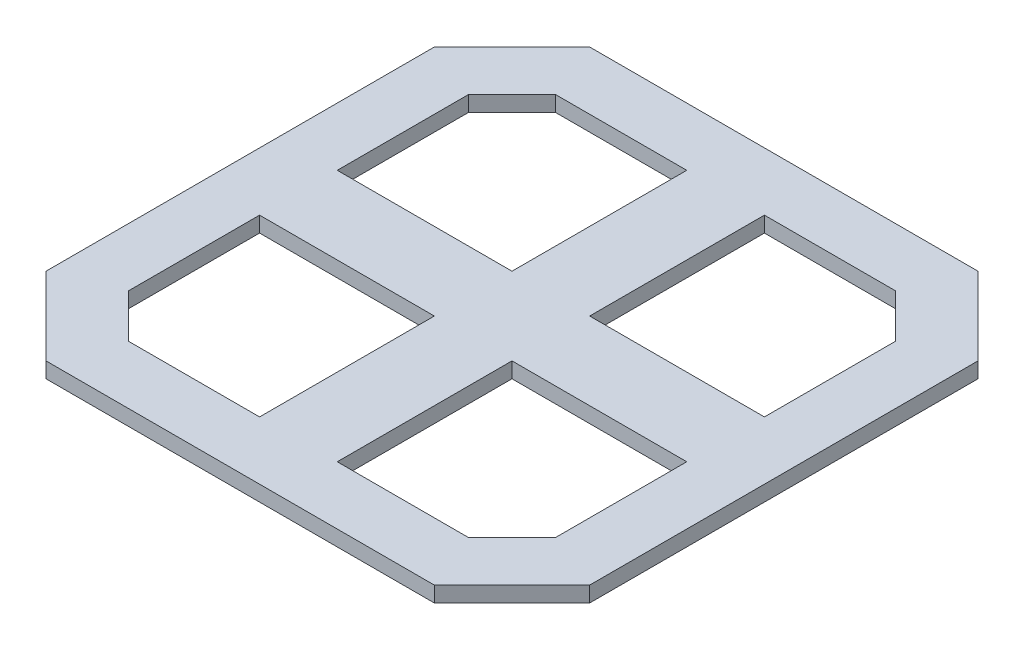
ISO-10303-21;
HEADER;
FILE_DESCRIPTION(('STEP AP214'),'2;1');
FILE_NAME('part.step','',(''),(''),'','','');
FILE_SCHEMA(('AUTOMOTIVE_DESIGN { 1 0 10303 214 1 1 1 1 }'));
ENDSEC;
DATA;
#1=APPLICATION_CONTEXT('core data for automotive mechanical design processes');
#2=APPLICATION_PROTOCOL_DEFINITION('international standard','automotive_design',2000,#1);
#3=PRODUCT_CONTEXT('',#1,'mechanical');
#4=PRODUCT('Part','Part','',(#3));
#5=PRODUCT_RELATED_PRODUCT_CATEGORY('part','',(#4));
#6=PRODUCT_DEFINITION_FORMATION('','',#4);
#7=PRODUCT_DEFINITION_CONTEXT('part definition',#1,'design');
#8=PRODUCT_DEFINITION('design','',#6,#7);
#9=PRODUCT_DEFINITION_SHAPE('','',#8);
#10=(LENGTH_UNIT() NAMED_UNIT(*) SI_UNIT(.MILLI.,.METRE.));
#11=(NAMED_UNIT(*) PLANE_ANGLE_UNIT() SI_UNIT($,.RADIAN.));
#12=(NAMED_UNIT(*) SI_UNIT($,.STERADIAN.) SOLID_ANGLE_UNIT());
#13=UNCERTAINTY_MEASURE_WITH_UNIT(LENGTH_MEASURE(1.E-05),#10,'distance_accuracy_value','');
#14=(GEOMETRIC_REPRESENTATION_CONTEXT(3) GLOBAL_UNCERTAINTY_ASSIGNED_CONTEXT((#13)) GLOBAL_UNIT_ASSIGNED_CONTEXT((#10,
#11,#12)) REPRESENTATION_CONTEXT('',''));
#15=CARTESIAN_POINT('',(0.,0.,0.));
#16=DIRECTION('',(0.,0.,1.));
#17=DIRECTION('',(1.,0.,0.));
#18=AXIS2_PLACEMENT_3D('',#15,#16,#17);
#19=CARTESIAN_POINT('',(35.,2.,-35.));
#20=DIRECTION('',(-1.,0.,0.));
#21=DIRECTION('',(0.,0.,1.));
#22=AXIS2_PLACEMENT_3D('',#19,#20,#21);
#23=PLANE('',#22);
#24=DIRECTION('',(0.,0.,-1.));
#25=VECTOR('',#24,1.);
#26=CARTESIAN_POINT('',(35.,0.,-35.));
#27=LINE('',#26,#25);
#28=CARTESIAN_POINT('',(35.,0.,25.));
#29=VERTEX_POINT('',#28);
#30=CARTESIAN_POINT('',(35.,0.,-24.9999999999994));
#31=VERTEX_POINT('',#30);
#32=EDGE_CURVE('E424',#29,#31,#27,.T.);
#33=ORIENTED_EDGE('',*,*,#32,.T.);
#34=DIRECTION('',(0.,-1.,0.));
#35=VECTOR('',#34,1.);
#36=CARTESIAN_POINT('',(35.0000000000003,33.8198051533949,-24.9999999999994));
#37=LINE('',#36,#35);
#38=CARTESIAN_POINT('',(35.0000000000003,2.,-24.9999999999994));
#39=VERTEX_POINT('',#38);
#40=EDGE_CURVE('E311',#39,#31,#37,.T.);
#41=ORIENTED_EDGE('',*,*,#40,.F.);
#42=DIRECTION('',(0.,0.,-1.));
#43=VECTOR('',#42,1.);
#44=CARTESIAN_POINT('',(35.,2.,-35.));
#45=LINE('',#44,#43);
#46=CARTESIAN_POINT('',(35.,2.,25.));
#47=VERTEX_POINT('',#46);
#48=EDGE_CURVE('E425',#47,#39,#45,.T.);
#49=ORIENTED_EDGE('',*,*,#48,.F.);
#50=DIRECTION('',(0.,-1.,0.));
#51=VECTOR('',#50,1.);
#52=CARTESIAN_POINT('',(35.,33.8198051533947,25.));
#53=LINE('',#52,#51);
#54=EDGE_CURVE('E418',#47,#29,#53,.T.);
#55=ORIENTED_EDGE('',*,*,#54,.T.);
#56=EDGE_LOOP('',(#33,#41,#49,#55));
#57=FACE_BOUND('',#56,.T.);
#58=ADVANCED_FACE('F36',(#57),#23,.F.);
#59=CARTESIAN_POINT('',(-35.,2.,-35.));
#60=DIRECTION('',(0.,0.,1.));
#61=DIRECTION('',(1.,0.,0.));
#62=AXIS2_PLACEMENT_3D('',#59,#60,#61);
#63=PLANE('',#62);
#64=DIRECTION('',(-1.,0.,0.));
#65=VECTOR('',#64,1.);
#66=CARTESIAN_POINT('',(-35.,2.,-35.));
#67=LINE('',#66,#65);
#68=CARTESIAN_POINT('',(25.0000000000004,2.,-34.9999999999997));
#69=VERTEX_POINT('',#68);
#70=CARTESIAN_POINT('',(-24.9999999999998,2.,-35.));
#71=VERTEX_POINT('',#70);
#72=EDGE_CURVE('E428',#69,#71,#67,.T.);
#73=ORIENTED_EDGE('',*,*,#72,.F.);
#74=DIRECTION('',(0.,-1.,0.));
#75=VECTOR('',#74,1.);
#76=CARTESIAN_POINT('',(25.0000000000004,33.8198051533949,-34.9999999999997));
#77=LINE('',#76,#75);
#78=CARTESIAN_POINT('',(25.0000000000004,0.,-34.9999999999997));
#79=VERTEX_POINT('',#78);
#80=EDGE_CURVE('E308',#69,#79,#77,.T.);
#81=ORIENTED_EDGE('',*,*,#80,.T.);
#82=DIRECTION('',(-1.,0.,0.));
#83=VECTOR('',#82,1.);
#84=CARTESIAN_POINT('',(-35.,0.,-35.));
#85=LINE('',#84,#83);
#86=CARTESIAN_POINT('',(-24.9999999999998,0.,-35.));
#87=VERTEX_POINT('',#86);
#88=EDGE_CURVE('E434',#79,#87,#85,.T.);
#89=ORIENTED_EDGE('',*,*,#88,.T.);
#90=DIRECTION('',(0.,-1.,0.));
#91=VECTOR('',#90,1.);
#92=CARTESIAN_POINT('',(-24.9999999999998,33.8198051533947,-35.));
#93=LINE('',#92,#91);
#94=EDGE_CURVE('E328',#71,#87,#93,.T.);
#95=ORIENTED_EDGE('',*,*,#94,.F.);
#96=EDGE_LOOP('',(#73,#81,#89,#95));
#97=FACE_BOUND('',#96,.T.);
#98=ADVANCED_FACE('F470',(#97),#63,.F.);
#99=CARTESIAN_POINT('',(-35.,2.,-35.));
#100=DIRECTION('',(1.,0.,0.));
#101=DIRECTION('',(0.,0.,-1.));
#102=AXIS2_PLACEMENT_3D('',#99,#100,#101);
#103=PLANE('',#102);
#104=DIRECTION('',(0.,0.,1.));
#105=VECTOR('',#104,1.);
#106=CARTESIAN_POINT('',(-35.,2.,-35.));
#107=LINE('',#106,#105);
#108=CARTESIAN_POINT('',(-35.,2.,-25.));
#109=VERTEX_POINT('',#108);
#110=CARTESIAN_POINT('',(-35.0000000000001,2.,24.9999999999996));
#111=VERTEX_POINT('',#110);
#112=EDGE_CURVE('E44',#109,#111,#107,.T.);
#113=ORIENTED_EDGE('',*,*,#112,.F.);
#114=DIRECTION('',(0.,-1.,0.));
#115=VECTOR('',#114,1.);
#116=CARTESIAN_POINT('',(-35.,33.8198051533947,-25.));
#117=LINE('',#116,#115);
#118=CARTESIAN_POINT('',(-35.,0.,-25.));
#119=VERTEX_POINT('',#118);
#120=EDGE_CURVE('E359',#109,#119,#117,.T.);
#121=ORIENTED_EDGE('',*,*,#120,.T.);
#122=DIRECTION('',(0.,0.,1.));
#123=VECTOR('',#122,1.);
#124=CARTESIAN_POINT('',(-35.,0.,-35.));
#125=LINE('',#124,#123);
#126=CARTESIAN_POINT('',(-35.,0.,24.9999999999996));
#127=VERTEX_POINT('',#126);
#128=EDGE_CURVE('E436',#119,#127,#125,.T.);
#129=ORIENTED_EDGE('',*,*,#128,.T.);
#130=DIRECTION('',(0.,-1.,0.));
#131=VECTOR('',#130,1.);
#132=CARTESIAN_POINT('',(-35.0000000000001,33.8198051533947,24.9999999999996));
#133=LINE('',#132,#131);
#134=EDGE_CURVE('E370',#111,#127,#133,.T.);
#135=ORIENTED_EDGE('',*,*,#134,.F.);
#136=EDGE_LOOP('',(#113,#121,#129,#135));
#137=FACE_BOUND('',#136,.T.);
#138=ADVANCED_FACE('F464',(#137),#103,.F.);
#139=CARTESIAN_POINT('',(-35.,2.,35.));
#140=DIRECTION('',(0.,0.,-1.));
#141=DIRECTION('',(-1.,0.,0.));
#142=AXIS2_PLACEMENT_3D('',#139,#140,#141);
#143=PLANE('',#142);
#144=DIRECTION('',(1.,0.,0.));
#145=VECTOR('',#144,1.);
#146=CARTESIAN_POINT('',(-35.,2.,35.));
#147=LINE('',#146,#145);
#148=CARTESIAN_POINT('',(-25.0000000000001,2.,34.9999999999999));
#149=VERTEX_POINT('',#148);
#150=CARTESIAN_POINT('',(24.9999999999998,2.,35.));
#151=VERTEX_POINT('',#150);
#152=EDGE_CURVE('E11',#149,#151,#147,.T.);
#153=ORIENTED_EDGE('',*,*,#152,.F.);
#154=DIRECTION('',(0.,-1.,0.));
#155=VECTOR('',#154,1.);
#156=CARTESIAN_POINT('',(-25.0000000000001,33.8198051533947,34.9999999999999));
#157=LINE('',#156,#155);
#158=CARTESIAN_POINT('',(-25.0000000000001,0.,34.9999999999999));
#159=VERTEX_POINT('',#158);
#160=EDGE_CURVE('E367',#149,#159,#157,.T.);
#161=ORIENTED_EDGE('',*,*,#160,.T.);
#162=DIRECTION('',(1.,0.,0.));
#163=VECTOR('',#162,1.);
#164=CARTESIAN_POINT('',(-35.,0.,35.));
#165=LINE('',#164,#163);
#166=CARTESIAN_POINT('',(24.9999999999998,0.,35.));
#167=VERTEX_POINT('',#166);
#168=EDGE_CURVE('E39',#159,#167,#165,.T.);
#169=ORIENTED_EDGE('',*,*,#168,.T.);
#170=DIRECTION('',(0.,-1.,0.));
#171=VECTOR('',#170,1.);
#172=CARTESIAN_POINT('',(24.9999999999998,33.8198051533947,35.));
#173=LINE('',#172,#171);
#174=EDGE_CURVE('E421',#151,#167,#173,.T.);
#175=ORIENTED_EDGE('',*,*,#174,.F.);
#176=EDGE_LOOP('',(#153,#161,#169,#175));
#177=FACE_BOUND('',#176,.T.);
#178=ADVANCED_FACE('F444',(#177),#143,.F.);
#179=CARTESIAN_POINT('',(0.,2.,0.));
#180=DIRECTION('',(0.,1.,0.));
#181=DIRECTION('',(0.,0.,1.));
#182=AXIS2_PLACEMENT_3D('',#179,#180,#181);
#183=PLANE('',#182);
#184=DIRECTION('',(-0.707106781186532,0.,-0.707106781186563));
#185=VECTOR('',#184,1.);
#186=CARTESIAN_POINT('',(35.0000000000003,2.,-24.9999999999994));
#187=LINE('',#186,#185);
#188=EDGE_CURVE('E305',#39,#69,#187,.T.);
#189=ORIENTED_EDGE('',*,*,#188,.T.);
#190=ORIENTED_EDGE('',*,*,#72,.T.);
#191=DIRECTION('',(-0.707106781186556,0.,0.707106781186539));
#192=VECTOR('',#191,1.);
#193=CARTESIAN_POINT('',(-24.9999999999998,2.,-35.));
#194=LINE('',#193,#192);
#195=EDGE_CURVE('E356',#71,#109,#194,.T.);
#196=ORIENTED_EDGE('',*,*,#195,.T.);
#197=ORIENTED_EDGE('',*,*,#112,.T.);
#198=DIRECTION('',(0.707106781186537,0.,0.707106781186558));
#199=VECTOR('',#198,1.);
#200=CARTESIAN_POINT('',(-35.0000000000001,2.,24.9999999999996));
#201=LINE('',#200,#199);
#202=EDGE_CURVE('E364',#111,#149,#201,.T.);
#203=ORIENTED_EDGE('',*,*,#202,.T.);
#204=ORIENTED_EDGE('',*,*,#152,.T.);
#205=DIRECTION('',(0.707106781186556,0.,-0.707106781186539));
#206=VECTOR('',#205,1.);
#207=CARTESIAN_POINT('',(24.9999999999998,2.,35.));
#208=LINE('',#207,#206);
#209=EDGE_CURVE('E415',#151,#47,#208,.T.);
#210=ORIENTED_EDGE('',*,*,#209,.T.);
#211=ORIENTED_EDGE('',*,*,#48,.T.);
#212=EDGE_LOOP('',(#189,#190,#196,#197,#203,#204,#210,#211));
#213=FACE_BOUND('',#212,.T.);
#214=DIRECTION('',(-1.,0.,0.));
#215=VECTOR('',#214,1.);
#216=CARTESIAN_POINT('',(5.00000000000005,2.,-4.99999999999995));
#217=LINE('',#216,#215);
#218=CARTESIAN_POINT('',(27.5000000000001,2.,-4.99999999999971));
#219=VERTEX_POINT('',#218);
#220=CARTESIAN_POINT('',(5.00000000000005,2.,-4.99999999999995));
#221=VERTEX_POINT('',#220);
#222=EDGE_CURVE('E267',#219,#221,#217,.T.);
#223=ORIENTED_EDGE('',*,*,#222,.T.);
#224=DIRECTION('',(0.,0.,-1.));
#225=VECTOR('',#224,1.);
#226=CARTESIAN_POINT('',(5.00000000000029,2.,-27.5));
#227=LINE('',#226,#225);
#228=CARTESIAN_POINT('',(5.00000000000029,2.,-27.5));
#229=VERTEX_POINT('',#228);
#230=EDGE_CURVE('E294',#221,#229,#227,.T.);
#231=ORIENTED_EDGE('',*,*,#230,.T.);
#232=DIRECTION('',(1.,0.,0.));
#233=VECTOR('',#232,1.);
#234=CARTESIAN_POINT('',(21.893398282202,2.,-27.4999999999998));
#235=LINE('',#234,#233);
#236=CARTESIAN_POINT('',(21.893398282202,2.,-27.4999999999998));
#237=VERTEX_POINT('',#236);
#238=EDGE_CURVE('E290',#229,#237,#235,.T.);
#239=ORIENTED_EDGE('',*,*,#238,.T.);
#240=DIRECTION('',(0.707106781186532,0.,0.707106781186563));
#241=VECTOR('',#240,1.);
#242=CARTESIAN_POINT('',(27.5000000000002,2.,-21.8933982822013));
#243=LINE('',#242,#241);
#244=CARTESIAN_POINT('',(27.5000000000002,2.,-21.8933982822013));
#245=VERTEX_POINT('',#244);
#246=EDGE_CURVE('E286',#237,#245,#243,.T.);
#247=ORIENTED_EDGE('',*,*,#246,.T.);
#248=DIRECTION('',(0.,0.,1.));
#249=VECTOR('',#248,1.);
#250=CARTESIAN_POINT('',(27.5000000000001,2.,-4.99999999999971));
#251=LINE('',#250,#249);
#252=EDGE_CURVE('E282',#245,#219,#251,.T.);
#253=ORIENTED_EDGE('',*,*,#252,.T.);
#254=EDGE_LOOP('',(#223,#231,#239,#247,#253));
#255=FACE_BOUND('',#254,.T.);
#256=DIRECTION('',(0.,0.,1.));
#257=VECTOR('',#256,1.);
#258=CARTESIAN_POINT('',(-5.,2.,-5.));
#259=LINE('',#258,#257);
#260=CARTESIAN_POINT('',(-5.,2.,-27.5));
#261=VERTEX_POINT('',#260);
#262=CARTESIAN_POINT('',(-5.,2.,-5.));
#263=VERTEX_POINT('',#262);
#264=EDGE_CURVE('E234',#261,#263,#259,.T.);
#265=ORIENTED_EDGE('',*,*,#264,.T.);
#266=DIRECTION('',(-1.,0.,0.));
#267=VECTOR('',#266,1.);
#268=CARTESIAN_POINT('',(-27.5,2.,-5.));
#269=LINE('',#268,#267);
#270=CARTESIAN_POINT('',(-27.5,2.,-5.));
#271=VERTEX_POINT('',#270);
#272=EDGE_CURVE('E221',#263,#271,#269,.T.);
#273=ORIENTED_EDGE('',*,*,#272,.T.);
#274=DIRECTION('',(0.,0.,-1.));
#275=VECTOR('',#274,1.);
#276=CARTESIAN_POINT('',(-27.5,2.,-21.8933982822017));
#277=LINE('',#276,#275);
#278=CARTESIAN_POINT('',(-27.5,2.,-21.8933982822017));
#279=VERTEX_POINT('',#278);
#280=EDGE_CURVE('E257',#271,#279,#277,.T.);
#281=ORIENTED_EDGE('',*,*,#280,.T.);
#282=DIRECTION('',(0.707106781186556,0.,-0.707106781186539));
#283=VECTOR('',#282,1.);
#284=CARTESIAN_POINT('',(-21.8933982822016,2.,-27.5));
#285=LINE('',#284,#283);
#286=CARTESIAN_POINT('',(-21.8933982822016,2.,-27.5));
#287=VERTEX_POINT('',#286);
#288=EDGE_CURVE('E254',#279,#287,#285,.T.);
#289=ORIENTED_EDGE('',*,*,#288,.T.);
#290=DIRECTION('',(1.,0.,0.));
#291=VECTOR('',#290,1.);
#292=CARTESIAN_POINT('',(-5.,2.,-27.5));
#293=LINE('',#292,#291);
#294=EDGE_CURVE('E243',#287,#261,#293,.T.);
#295=ORIENTED_EDGE('',*,*,#294,.T.);
#296=EDGE_LOOP('',(#265,#273,#281,#289,#295));
#297=FACE_BOUND('',#296,.T.);
#298=DIRECTION('',(1.,0.,0.));
#299=VECTOR('',#298,1.);
#300=CARTESIAN_POINT('',(-5.00000000000001,2.,4.99999999999998));
#301=LINE('',#300,#299);
#302=CARTESIAN_POINT('',(-27.5,2.,4.9999999999999));
#303=VERTEX_POINT('',#302);
#304=CARTESIAN_POINT('',(-5.00000000000001,2.,4.99999999999998));
#305=VERTEX_POINT('',#304);
#306=EDGE_CURVE('E315',#303,#305,#301,.T.);
#307=ORIENTED_EDGE('',*,*,#306,.T.);
#308=DIRECTION('',(0.,0.,1.));
#309=VECTOR('',#308,1.);
#310=CARTESIAN_POINT('',(-5.0000000000001,2.,27.5));
#311=LINE('',#310,#309);
#312=CARTESIAN_POINT('',(-5.0000000000001,2.,27.5));
#313=VERTEX_POINT('',#312);
#314=EDGE_CURVE('E345',#305,#313,#311,.T.);
#315=ORIENTED_EDGE('',*,*,#314,.T.);
#316=DIRECTION('',(-1.,0.,0.));
#317=VECTOR('',#316,1.);
#318=CARTESIAN_POINT('',(-21.8933982822018,2.,27.4999999999999));
#319=LINE('',#318,#317);
#320=CARTESIAN_POINT('',(-21.8933982822018,2.,27.4999999999999));
#321=VERTEX_POINT('',#320);
#322=EDGE_CURVE('E341',#313,#321,#319,.T.);
#323=ORIENTED_EDGE('',*,*,#322,.T.);
#324=DIRECTION('',(-0.707106781186537,0.,-0.707106781186558));
#325=VECTOR('',#324,1.);
#326=CARTESIAN_POINT('',(-27.5000000000001,2.,21.8933982822015));
#327=LINE('',#326,#325);
#328=CARTESIAN_POINT('',(-27.5000000000001,2.,21.8933982822015));
#329=VERTEX_POINT('',#328);
#330=EDGE_CURVE('E337',#321,#329,#327,.T.);
#331=ORIENTED_EDGE('',*,*,#330,.T.);
#332=DIRECTION('',(0.,0.,-1.));
#333=VECTOR('',#332,1.);
#334=CARTESIAN_POINT('',(-27.5,2.,4.9999999999999));
#335=LINE('',#334,#333);
#336=EDGE_CURVE('E332',#329,#303,#335,.T.);
#337=ORIENTED_EDGE('',*,*,#336,.T.);
#338=EDGE_LOOP('',(#307,#315,#323,#331,#337));
#339=FACE_BOUND('',#338,.T.);
#340=DIRECTION('',(0.,0.,-1.));
#341=VECTOR('',#340,1.);
#342=CARTESIAN_POINT('',(5.,2.,5.));
#343=LINE('',#342,#341);
#344=CARTESIAN_POINT('',(5.,2.,27.5));
#345=VERTEX_POINT('',#344);
#346=CARTESIAN_POINT('',(5.,2.,5.));
#347=VERTEX_POINT('',#346);
#348=EDGE_CURVE('E376',#345,#347,#343,.T.);
#349=ORIENTED_EDGE('',*,*,#348,.T.);
#350=DIRECTION('',(1.,0.,0.));
#351=VECTOR('',#350,1.);
#352=CARTESIAN_POINT('',(27.5,2.,5.));
#353=LINE('',#352,#351);
#354=CARTESIAN_POINT('',(27.5,2.,5.));
#355=VERTEX_POINT('',#354);
#356=EDGE_CURVE('E404',#347,#355,#353,.T.);
#357=ORIENTED_EDGE('',*,*,#356,.T.);
#358=DIRECTION('',(0.,0.,1.));
#359=VECTOR('',#358,1.);
#360=CARTESIAN_POINT('',(27.5,2.,21.8933982822017));
#361=LINE('',#360,#359);
#362=CARTESIAN_POINT('',(27.5,2.,21.8933982822017));
#363=VERTEX_POINT('',#362);
#364=EDGE_CURVE('E400',#355,#363,#361,.T.);
#365=ORIENTED_EDGE('',*,*,#364,.T.);
#366=DIRECTION('',(-0.707106781186556,0.,0.707106781186539));
#367=VECTOR('',#366,1.);
#368=CARTESIAN_POINT('',(21.8933982822016,2.,27.5));
#369=LINE('',#368,#367);
#370=CARTESIAN_POINT('',(21.8933982822016,2.,27.5));
#371=VERTEX_POINT('',#370);
#372=EDGE_CURVE('E396',#363,#371,#369,.T.);
#373=ORIENTED_EDGE('',*,*,#372,.T.);
#374=DIRECTION('',(-1.,0.,0.));
#375=VECTOR('',#374,1.);
#376=CARTESIAN_POINT('',(5.,2.,27.5));
#377=LINE('',#376,#375);
#378=EDGE_CURVE('E391',#371,#345,#377,.T.);
#379=ORIENTED_EDGE('',*,*,#378,.T.);
#380=EDGE_LOOP('',(#349,#357,#365,#373,#379));
#381=FACE_BOUND('',#380,.T.);
#382=ADVANCED_FACE('F240',(#213,#255,#297,#339,#381),#183,.T.);
#383=CARTESIAN_POINT('',(0.,0.,0.));
#384=DIRECTION('',(0.,1.,0.));
#385=DIRECTION('',(0.,0.,1.));
#386=AXIS2_PLACEMENT_3D('',#383,#384,#385);
#387=PLANE('',#386);
#388=DIRECTION('',(0.,0.,-1.));
#389=VECTOR('',#388,1.);
#390=CARTESIAN_POINT('',(5.00000000000029,0.,-27.5));
#391=LINE('',#390,#389);
#392=CARTESIAN_POINT('',(5.00000000000005,0.,-4.99999999999995));
#393=VERTEX_POINT('',#392);
#394=CARTESIAN_POINT('',(5.00000000000029,0.,-27.5));
#395=VERTEX_POINT('',#394);
#396=EDGE_CURVE('E271',#393,#395,#391,.T.);
#397=ORIENTED_EDGE('',*,*,#396,.F.);
#398=DIRECTION('',(-1.,0.,0.));
#399=VECTOR('',#398,1.);
#400=CARTESIAN_POINT('',(5.00000000000005,0.,-4.99999999999995));
#401=LINE('',#400,#399);
#402=CARTESIAN_POINT('',(27.5000000000001,0.,-4.99999999999971));
#403=VERTEX_POINT('',#402);
#404=EDGE_CURVE('E274',#403,#393,#401,.T.);
#405=ORIENTED_EDGE('',*,*,#404,.F.);
#406=DIRECTION('',(0.,0.,1.));
#407=VECTOR('',#406,1.);
#408=CARTESIAN_POINT('',(27.5000000000001,0.,-4.99999999999971));
#409=LINE('',#408,#407);
#410=CARTESIAN_POINT('',(27.5000000000002,0.,-21.8933982822013));
#411=VERTEX_POINT('',#410);
#412=EDGE_CURVE('E277',#411,#403,#409,.T.);
#413=ORIENTED_EDGE('',*,*,#412,.F.);
#414=DIRECTION('',(0.707106781186532,0.,0.707106781186563));
#415=VECTOR('',#414,1.);
#416=CARTESIAN_POINT('',(27.5000000000002,0.,-21.8933982822013));
#417=LINE('',#416,#415);
#418=CARTESIAN_POINT('',(21.893398282202,0.,-27.4999999999998));
#419=VERTEX_POINT('',#418);
#420=EDGE_CURVE('E265',#419,#411,#417,.T.);
#421=ORIENTED_EDGE('',*,*,#420,.F.);
#422=DIRECTION('',(1.,0.,0.));
#423=VECTOR('',#422,1.);
#424=CARTESIAN_POINT('',(21.893398282202,0.,-27.4999999999998));
#425=LINE('',#424,#423);
#426=EDGE_CURVE('E268',#395,#419,#425,.T.);
#427=ORIENTED_EDGE('',*,*,#426,.F.);
#428=EDGE_LOOP('',(#397,#405,#413,#421,#427));
#429=FACE_BOUND('',#428,.T.);
#430=DIRECTION('',(-1.,0.,0.));
#431=VECTOR('',#430,1.);
#432=CARTESIAN_POINT('',(-27.5,0.,-5.));
#433=LINE('',#432,#431);
#434=CARTESIAN_POINT('',(-5.,0.,-5.));
#435=VERTEX_POINT('',#434);
#436=CARTESIAN_POINT('',(-27.5,0.,-5.));
#437=VERTEX_POINT('',#436);
#438=EDGE_CURVE('E585',#435,#437,#433,.T.);
#439=ORIENTED_EDGE('',*,*,#438,.F.);
#440=DIRECTION('',(0.,0.,1.));
#441=VECTOR('',#440,1.);
#442=CARTESIAN_POINT('',(-5.,0.,-5.));
#443=LINE('',#442,#441);
#444=CARTESIAN_POINT('',(-5.,0.,-27.5));
#445=VERTEX_POINT('',#444);
#446=EDGE_CURVE('E237',#445,#435,#443,.T.);
#447=ORIENTED_EDGE('',*,*,#446,.F.);
#448=DIRECTION('',(1.,0.,0.));
#449=VECTOR('',#448,1.);
#450=CARTESIAN_POINT('',(-5.,0.,-27.5));
#451=LINE('',#450,#449);
#452=CARTESIAN_POINT('',(-21.8933982822016,0.,-27.5));
#453=VERTEX_POINT('',#452);
#454=EDGE_CURVE('E250',#453,#445,#451,.T.);
#455=ORIENTED_EDGE('',*,*,#454,.F.);
#456=DIRECTION('',(0.707106781186556,0.,-0.707106781186539));
#457=VECTOR('',#456,1.);
#458=CARTESIAN_POINT('',(-21.8933982822016,0.,-27.5));
#459=LINE('',#458,#457);
#460=CARTESIAN_POINT('',(-27.5,0.,-21.8933982822017));
#461=VERTEX_POINT('',#460);
#462=EDGE_CURVE('E244',#461,#453,#459,.T.);
#463=ORIENTED_EDGE('',*,*,#462,.F.);
#464=DIRECTION('',(0.,0.,-1.));
#465=VECTOR('',#464,1.);
#466=CARTESIAN_POINT('',(-27.5,0.,-21.8933982822017));
#467=LINE('',#466,#465);
#468=EDGE_CURVE('E246',#437,#461,#467,.T.);
#469=ORIENTED_EDGE('',*,*,#468,.F.);
#470=EDGE_LOOP('',(#439,#447,#455,#463,#469));
#471=FACE_BOUND('',#470,.T.);
#472=DIRECTION('',(0.,0.,1.));
#473=VECTOR('',#472,1.);
#474=CARTESIAN_POINT('',(-5.0000000000001,0.,27.5));
#475=LINE('',#474,#473);
#476=CARTESIAN_POINT('',(-5.00000000000001,0.,4.99999999999998));
#477=VERTEX_POINT('',#476);
#478=CARTESIAN_POINT('',(-5.0000000000001,0.,27.5));
#479=VERTEX_POINT('',#478);
#480=EDGE_CURVE('E319',#477,#479,#475,.T.);
#481=ORIENTED_EDGE('',*,*,#480,.F.);
#482=DIRECTION('',(1.,0.,0.));
#483=VECTOR('',#482,1.);
#484=CARTESIAN_POINT('',(-5.00000000000001,0.,4.99999999999998));
#485=LINE('',#484,#483);
#486=CARTESIAN_POINT('',(-27.5,0.,4.9999999999999));
#487=VERTEX_POINT('',#486);
#488=EDGE_CURVE('E322',#487,#477,#485,.T.);
#489=ORIENTED_EDGE('',*,*,#488,.F.);
#490=DIRECTION('',(0.,0.,-1.));
#491=VECTOR('',#490,1.);
#492=CARTESIAN_POINT('',(-27.5,0.,4.9999999999999));
#493=LINE('',#492,#491);
#494=CARTESIAN_POINT('',(-27.5000000000001,0.,21.8933982822015));
#495=VERTEX_POINT('',#494);
#496=EDGE_CURVE('E325',#495,#487,#493,.T.);
#497=ORIENTED_EDGE('',*,*,#496,.F.);
#498=DIRECTION('',(-0.707106781186537,0.,-0.707106781186558));
#499=VECTOR('',#498,1.);
#500=CARTESIAN_POINT('',(-27.5000000000001,0.,21.8933982822015));
#501=LINE('',#500,#499);
#502=CARTESIAN_POINT('',(-21.8933982822018,0.,27.4999999999999));
#503=VERTEX_POINT('',#502);
#504=EDGE_CURVE('E313',#503,#495,#501,.T.);
#505=ORIENTED_EDGE('',*,*,#504,.F.);
#506=DIRECTION('',(-1.,0.,0.));
#507=VECTOR('',#506,1.);
#508=CARTESIAN_POINT('',(-21.8933982822018,0.,27.4999999999999));
#509=LINE('',#508,#507);
#510=EDGE_CURVE('E316',#479,#503,#509,.T.);
#511=ORIENTED_EDGE('',*,*,#510,.F.);
#512=EDGE_LOOP('',(#481,#489,#497,#505,#511));
#513=FACE_BOUND('',#512,.T.);
#514=DIRECTION('',(1.,0.,0.));
#515=VECTOR('',#514,1.);
#516=CARTESIAN_POINT('',(27.5,0.,5.));
#517=LINE('',#516,#515);
#518=CARTESIAN_POINT('',(5.,0.,5.));
#519=VERTEX_POINT('',#518);
#520=CARTESIAN_POINT('',(27.5,0.,5.));
#521=VERTEX_POINT('',#520);
#522=EDGE_CURVE('E380',#519,#521,#517,.T.);
#523=ORIENTED_EDGE('',*,*,#522,.F.);
#524=DIRECTION('',(0.,0.,-1.));
#525=VECTOR('',#524,1.);
#526=CARTESIAN_POINT('',(5.,0.,5.));
#527=LINE('',#526,#525);
#528=CARTESIAN_POINT('',(5.,0.,27.5));
#529=VERTEX_POINT('',#528);
#530=EDGE_CURVE('E383',#529,#519,#527,.T.);
#531=ORIENTED_EDGE('',*,*,#530,.F.);
#532=DIRECTION('',(-1.,0.,0.));
#533=VECTOR('',#532,1.);
#534=CARTESIAN_POINT('',(5.,0.,27.5));
#535=LINE('',#534,#533);
#536=CARTESIAN_POINT('',(21.8933982822016,0.,27.5));
#537=VERTEX_POINT('',#536);
#538=EDGE_CURVE('E373',#537,#529,#535,.T.);
#539=ORIENTED_EDGE('',*,*,#538,.F.);
#540=DIRECTION('',(-0.707106781186556,0.,0.707106781186539));
#541=VECTOR('',#540,1.);
#542=CARTESIAN_POINT('',(21.8933982822016,0.,27.5));
#543=LINE('',#542,#541);
#544=CARTESIAN_POINT('',(27.5,0.,21.8933982822017));
#545=VERTEX_POINT('',#544);
#546=EDGE_CURVE('E374',#545,#537,#543,.T.);
#547=ORIENTED_EDGE('',*,*,#546,.F.);
#548=DIRECTION('',(0.,0.,1.));
#549=VECTOR('',#548,1.);
#550=CARTESIAN_POINT('',(27.5,0.,21.8933982822017));
#551=LINE('',#550,#549);
#552=EDGE_CURVE('E377',#521,#545,#551,.T.);
#553=ORIENTED_EDGE('',*,*,#552,.F.);
#554=EDGE_LOOP('',(#523,#531,#539,#547,#553));
#555=FACE_BOUND('',#554,.T.);
#556=ORIENTED_EDGE('',*,*,#88,.F.);
#557=DIRECTION('',(-0.707106781186532,0.,-0.707106781186563));
#558=VECTOR('',#557,1.);
#559=CARTESIAN_POINT('',(35.0000000000003,0.,-24.9999999999994));
#560=LINE('',#559,#558);
#561=EDGE_CURVE('E303',#31,#79,#560,.T.);
#562=ORIENTED_EDGE('',*,*,#561,.F.);
#563=ORIENTED_EDGE('',*,*,#32,.F.);
#564=DIRECTION('',(0.707106781186556,0.,-0.707106781186539));
#565=VECTOR('',#564,1.);
#566=CARTESIAN_POINT('',(24.9999999999998,0.,35.));
#567=LINE('',#566,#565);
#568=EDGE_CURVE('E413',#167,#29,#567,.T.);
#569=ORIENTED_EDGE('',*,*,#568,.F.);
#570=ORIENTED_EDGE('',*,*,#168,.F.);
#571=DIRECTION('',(0.707106781186537,0.,0.707106781186558));
#572=VECTOR('',#571,1.);
#573=CARTESIAN_POINT('',(-35.0000000000001,0.,24.9999999999996));
#574=LINE('',#573,#572);
#575=EDGE_CURVE('E354',#127,#159,#574,.T.);
#576=ORIENTED_EDGE('',*,*,#575,.F.);
#577=ORIENTED_EDGE('',*,*,#128,.F.);
#578=DIRECTION('',(-0.707106781186556,0.,0.707106781186539));
#579=VECTOR('',#578,1.);
#580=CARTESIAN_POINT('',(-24.9999999999998,0.,-35.));
#581=LINE('',#580,#579);
#582=EDGE_CURVE('E264',#87,#119,#581,.T.);
#583=ORIENTED_EDGE('',*,*,#582,.F.);
#584=EDGE_LOOP('',(#556,#562,#563,#569,#570,#576,#577,#583));
#585=FACE_BOUND('',#584,.T.);
#586=ADVANCED_FACE('F453',(#429,#471,#513,#555,#585),#387,.F.);
#587=CARTESIAN_POINT('',(24.9999999999998,33.8198051533947,35.));
#588=DIRECTION('',(-0.707106781186539,0.,-0.707106781186556));
#589=DIRECTION('',(-0.707106781186556,0.,0.707106781186539));
#590=AXIS2_PLACEMENT_3D('',#587,#588,#589);
#591=PLANE('',#590);
#592=ORIENTED_EDGE('',*,*,#174,.T.);
#593=ORIENTED_EDGE('',*,*,#568,.T.);
#594=ORIENTED_EDGE('',*,*,#54,.F.);
#595=ORIENTED_EDGE('',*,*,#209,.F.);
#596=EDGE_LOOP('',(#592,#593,#594,#595));
#597=FACE_BOUND('',#596,.T.);
#598=ADVANCED_FACE('F450',(#597),#591,.F.);
#599=CARTESIAN_POINT('',(5.,33.8198051533947,5.));
#600=DIRECTION('',(-1.,0.,0.));
#601=DIRECTION('',(0.,0.,1.));
#602=AXIS2_PLACEMENT_3D('',#599,#600,#601);
#603=PLANE('',#602);
#604=DIRECTION('',(0.,-1.,0.));
#605=VECTOR('',#604,1.);
#606=CARTESIAN_POINT('',(5.,33.8198051533947,27.5));
#607=LINE('',#606,#605);
#608=EDGE_CURVE('E394',#345,#529,#607,.T.);
#609=ORIENTED_EDGE('',*,*,#608,.T.);
#610=ORIENTED_EDGE('',*,*,#530,.T.);
#611=DIRECTION('',(0.,-1.,0.));
#612=VECTOR('',#611,1.);
#613=CARTESIAN_POINT('',(5.,33.8198051533947,5.));
#614=LINE('',#613,#612);
#615=EDGE_CURVE('E390',#347,#519,#614,.T.);
#616=ORIENTED_EDGE('',*,*,#615,.F.);
#617=ORIENTED_EDGE('',*,*,#348,.F.);
#618=EDGE_LOOP('',(#609,#610,#616,#617));
#619=FACE_BOUND('',#618,.T.);
#620=ADVANCED_FACE('F505',(#619),#603,.F.);
#621=CARTESIAN_POINT('',(27.5,33.8198051533947,5.));
#622=DIRECTION('',(0.,0.,-1.));
#623=DIRECTION('',(-1.,0.,0.));
#624=AXIS2_PLACEMENT_3D('',#621,#622,#623);
#625=PLANE('',#624);
#626=ORIENTED_EDGE('',*,*,#615,.T.);
#627=ORIENTED_EDGE('',*,*,#522,.T.);
#628=DIRECTION('',(0.,-1.,0.));
#629=VECTOR('',#628,1.);
#630=CARTESIAN_POINT('',(27.5,33.8198051533947,5.));
#631=LINE('',#630,#629);
#632=EDGE_CURVE('E403',#355,#521,#631,.T.);
#633=ORIENTED_EDGE('',*,*,#632,.F.);
#634=ORIENTED_EDGE('',*,*,#356,.F.);
#635=EDGE_LOOP('',(#626,#627,#633,#634));
#636=FACE_BOUND('',#635,.T.);
#637=ADVANCED_FACE('F508',(#636),#625,.F.);
#638=CARTESIAN_POINT('',(27.5,33.8198051533947,21.8933982822017));
#639=DIRECTION('',(1.,0.,0.));
#640=DIRECTION('',(0.,0.,-1.));
#641=AXIS2_PLACEMENT_3D('',#638,#639,#640);
#642=PLANE('',#641);
#643=ORIENTED_EDGE('',*,*,#632,.T.);
#644=ORIENTED_EDGE('',*,*,#552,.T.);
#645=DIRECTION('',(0.,-1.,0.));
#646=VECTOR('',#645,1.);
#647=CARTESIAN_POINT('',(27.5,33.8198051533947,21.8933982822017));
#648=LINE('',#647,#646);
#649=EDGE_CURVE('E399',#363,#545,#648,.T.);
#650=ORIENTED_EDGE('',*,*,#649,.F.);
#651=ORIENTED_EDGE('',*,*,#364,.F.);
#652=EDGE_LOOP('',(#643,#644,#650,#651));
#653=FACE_BOUND('',#652,.T.);
#654=ADVANCED_FACE('F512',(#653),#642,.F.);
#655=CARTESIAN_POINT('',(21.8933982822016,33.8198051533947,27.5));
#656=DIRECTION('',(0.707106781186539,0.,0.707106781186556));
#657=DIRECTION('',(0.707106781186556,0.,-0.707106781186539));
#658=AXIS2_PLACEMENT_3D('',#655,#656,#657);
#659=PLANE('',#658);
#660=ORIENTED_EDGE('',*,*,#649,.T.);
#661=ORIENTED_EDGE('',*,*,#546,.T.);
#662=DIRECTION('',(0.,-1.,0.));
#663=VECTOR('',#662,1.);
#664=CARTESIAN_POINT('',(21.8933982822016,33.8198051533947,27.5));
#665=LINE('',#664,#663);
#666=EDGE_CURVE('E395',#371,#537,#665,.T.);
#667=ORIENTED_EDGE('',*,*,#666,.F.);
#668=ORIENTED_EDGE('',*,*,#372,.F.);
#669=EDGE_LOOP('',(#660,#661,#667,#668));
#670=FACE_BOUND('',#669,.T.);
#671=ADVANCED_FACE('F516',(#670),#659,.F.);
#672=CARTESIAN_POINT('',(5.,33.8198051533947,27.5));
#673=DIRECTION('',(0.,0.,1.));
#674=DIRECTION('',(1.,0.,0.));
#675=AXIS2_PLACEMENT_3D('',#672,#673,#674);
#676=PLANE('',#675);
#677=ORIENTED_EDGE('',*,*,#666,.T.);
#678=ORIENTED_EDGE('',*,*,#538,.T.);
#679=ORIENTED_EDGE('',*,*,#608,.F.);
#680=ORIENTED_EDGE('',*,*,#378,.F.);
#681=EDGE_LOOP('',(#677,#678,#679,#680));
#682=FACE_BOUND('',#681,.T.);
#683=ADVANCED_FACE('F520',(#682),#676,.F.);
#684=CARTESIAN_POINT('',(-35.0000000000001,33.8198051533947,24.9999999999996));
#685=DIRECTION('',(0.707106781186558,0.,-0.707106781186537));
#686=DIRECTION('',(-0.707106781186537,0.,-0.707106781186558));
#687=AXIS2_PLACEMENT_3D('',#684,#685,#686);
#688=PLANE('',#687);
#689=ORIENTED_EDGE('',*,*,#134,.T.);
#690=ORIENTED_EDGE('',*,*,#575,.T.);
#691=ORIENTED_EDGE('',*,*,#160,.F.);
#692=ORIENTED_EDGE('',*,*,#202,.F.);
#693=EDGE_LOOP('',(#689,#690,#691,#692));
#694=FACE_BOUND('',#693,.T.);
#695=ADVANCED_FACE('F463',(#694),#688,.F.);
#696=CARTESIAN_POINT('',(-5.00000000000001,33.8198051533947,4.99999999999998));
#697=DIRECTION('',(0.,0.,-1.));
#698=DIRECTION('',(-1.,0.,0.));
#699=AXIS2_PLACEMENT_3D('',#696,#697,#698);
#700=PLANE('',#699);
#701=DIRECTION('',(0.,-1.,0.));
#702=VECTOR('',#701,1.);
#703=CARTESIAN_POINT('',(-27.5,33.8198051533947,4.9999999999999));
#704=LINE('',#703,#702);
#705=EDGE_CURVE('E335',#303,#487,#704,.T.);
#706=ORIENTED_EDGE('',*,*,#705,.T.);
#707=ORIENTED_EDGE('',*,*,#488,.T.);
#708=DIRECTION('',(0.,-1.,0.));
#709=VECTOR('',#708,1.);
#710=CARTESIAN_POINT('',(-5.00000000000001,33.8198051533947,4.99999999999998));
#711=LINE('',#710,#709);
#712=EDGE_CURVE('E331',#305,#477,#711,.T.);
#713=ORIENTED_EDGE('',*,*,#712,.F.);
#714=ORIENTED_EDGE('',*,*,#306,.F.);
#715=EDGE_LOOP('',(#706,#707,#713,#714));
#716=FACE_BOUND('',#715,.T.);
#717=ADVANCED_FACE('F525',(#716),#700,.F.);
#718=CARTESIAN_POINT('',(-5.0000000000001,33.8198051533947,27.5));
#719=DIRECTION('',(1.,0.,0.));
#720=DIRECTION('',(0.,0.,-1.));
#721=AXIS2_PLACEMENT_3D('',#718,#719,#720);
#722=PLANE('',#721);
#723=ORIENTED_EDGE('',*,*,#712,.T.);
#724=ORIENTED_EDGE('',*,*,#480,.T.);
#725=DIRECTION('',(0.,-1.,0.));
#726=VECTOR('',#725,1.);
#727=CARTESIAN_POINT('',(-5.0000000000001,33.8198051533947,27.5));
#728=LINE('',#727,#726);
#729=EDGE_CURVE('E344',#313,#479,#728,.T.);
#730=ORIENTED_EDGE('',*,*,#729,.F.);
#731=ORIENTED_EDGE('',*,*,#314,.F.);
#732=EDGE_LOOP('',(#723,#724,#730,#731));
#733=FACE_BOUND('',#732,.T.);
#734=ADVANCED_FACE('F529',(#733),#722,.F.);
#735=CARTESIAN_POINT('',(-21.8933982822018,33.8198051533947,27.4999999999999));
#736=DIRECTION('',(0.,0.,1.));
#737=DIRECTION('',(1.,0.,0.));
#738=AXIS2_PLACEMENT_3D('',#735,#736,#737);
#739=PLANE('',#738);
#740=ORIENTED_EDGE('',*,*,#729,.T.);
#741=ORIENTED_EDGE('',*,*,#510,.T.);
#742=DIRECTION('',(0.,-1.,0.));
#743=VECTOR('',#742,1.);
#744=CARTESIAN_POINT('',(-21.8933982822018,33.8198051533947,27.4999999999999));
#745=LINE('',#744,#743);
#746=EDGE_CURVE('E340',#321,#503,#745,.T.);
#747=ORIENTED_EDGE('',*,*,#746,.F.);
#748=ORIENTED_EDGE('',*,*,#322,.F.);
#749=EDGE_LOOP('',(#740,#741,#747,#748));
#750=FACE_BOUND('',#749,.T.);
#751=ADVANCED_FACE('F534',(#750),#739,.F.);
#752=CARTESIAN_POINT('',(-27.5000000000001,33.8198051533947,21.8933982822015));
#753=DIRECTION('',(-0.707106781186558,0.,0.707106781186537));
#754=DIRECTION('',(0.707106781186537,0.,0.707106781186558));
#755=AXIS2_PLACEMENT_3D('',#752,#753,#754);
#756=PLANE('',#755);
#757=ORIENTED_EDGE('',*,*,#746,.T.);
#758=ORIENTED_EDGE('',*,*,#504,.T.);
#759=DIRECTION('',(0.,-1.,0.));
#760=VECTOR('',#759,1.);
#761=CARTESIAN_POINT('',(-27.5000000000001,33.8198051533947,21.8933982822015));
#762=LINE('',#761,#760);
#763=EDGE_CURVE('E336',#329,#495,#762,.T.);
#764=ORIENTED_EDGE('',*,*,#763,.F.);
#765=ORIENTED_EDGE('',*,*,#330,.F.);
#766=EDGE_LOOP('',(#757,#758,#764,#765));
#767=FACE_BOUND('',#766,.T.);
#768=ADVANCED_FACE('F482',(#767),#756,.F.);
#769=CARTESIAN_POINT('',(-27.5,33.8198051533947,4.9999999999999));
#770=DIRECTION('',(-1.,0.,0.));
#771=DIRECTION('',(0.,0.,1.));
#772=AXIS2_PLACEMENT_3D('',#769,#770,#771);
#773=PLANE('',#772);
#774=ORIENTED_EDGE('',*,*,#763,.T.);
#775=ORIENTED_EDGE('',*,*,#496,.T.);
#776=ORIENTED_EDGE('',*,*,#705,.F.);
#777=ORIENTED_EDGE('',*,*,#336,.F.);
#778=EDGE_LOOP('',(#774,#775,#776,#777));
#779=FACE_BOUND('',#778,.T.);
#780=ADVANCED_FACE('F475',(#779),#773,.F.);
#781=CARTESIAN_POINT('',(-24.9999999999998,33.8198051533947,-35.));
#782=DIRECTION('',(0.707106781186539,0.,0.707106781186556));
#783=DIRECTION('',(0.707106781186556,0.,-0.707106781186539));
#784=AXIS2_PLACEMENT_3D('',#781,#782,#783);
#785=PLANE('',#784);
#786=ORIENTED_EDGE('',*,*,#94,.T.);
#787=ORIENTED_EDGE('',*,*,#582,.T.);
#788=ORIENTED_EDGE('',*,*,#120,.F.);
#789=ORIENTED_EDGE('',*,*,#195,.F.);
#790=EDGE_LOOP('',(#786,#787,#788,#789));
#791=FACE_BOUND('',#790,.T.);
#792=ADVANCED_FACE('F473',(#791),#785,.F.);
#793=CARTESIAN_POINT('',(-5.,33.8198051533947,-5.));
#794=DIRECTION('',(1.,0.,0.));
#795=DIRECTION('',(0.,0.,-1.));
#796=AXIS2_PLACEMENT_3D('',#793,#794,#795);
#797=PLANE('',#796);
#798=DIRECTION('',(0.,-1.,0.));
#799=VECTOR('',#798,1.);
#800=CARTESIAN_POINT('',(-5.,33.8198051533947,-27.5));
#801=LINE('',#800,#799);
#802=EDGE_CURVE('E60',#261,#445,#801,.T.);
#803=ORIENTED_EDGE('',*,*,#802,.T.);
#804=ORIENTED_EDGE('',*,*,#446,.T.);
#805=DIRECTION('',(0.,-1.,0.));
#806=VECTOR('',#805,1.);
#807=CARTESIAN_POINT('',(-5.,33.8198051533947,-5.));
#808=LINE('',#807,#806);
#809=EDGE_CURVE('E225',#263,#435,#808,.T.);
#810=ORIENTED_EDGE('',*,*,#809,.F.);
#811=ORIENTED_EDGE('',*,*,#264,.F.);
#812=EDGE_LOOP('',(#803,#804,#810,#811));
#813=FACE_BOUND('',#812,.T.);
#814=ADVANCED_FACE('F233',(#813),#797,.F.);
#815=CARTESIAN_POINT('',(-27.5,33.8198051533947,-5.));
#816=DIRECTION('',(0.,0.,1.));
#817=DIRECTION('',(1.,0.,0.));
#818=AXIS2_PLACEMENT_3D('',#815,#816,#817);
#819=PLANE('',#818);
#820=ORIENTED_EDGE('',*,*,#809,.T.);
#821=ORIENTED_EDGE('',*,*,#438,.T.);
#822=DIRECTION('',(0.,-1.,0.));
#823=VECTOR('',#822,1.);
#824=CARTESIAN_POINT('',(-27.5,33.8198051533947,-5.));
#825=LINE('',#824,#823);
#826=EDGE_CURVE('E227',#271,#437,#825,.T.);
#827=ORIENTED_EDGE('',*,*,#826,.F.);
#828=ORIENTED_EDGE('',*,*,#272,.F.);
#829=EDGE_LOOP('',(#820,#821,#827,#828));
#830=FACE_BOUND('',#829,.T.);
#831=ADVANCED_FACE('F223',(#830),#819,.F.);
#832=CARTESIAN_POINT('',(-27.5,33.8198051533947,-21.8933982822017));
#833=DIRECTION('',(-1.,0.,0.));
#834=DIRECTION('',(0.,0.,1.));
#835=AXIS2_PLACEMENT_3D('',#832,#833,#834);
#836=PLANE('',#835);
#837=ORIENTED_EDGE('',*,*,#826,.T.);
#838=ORIENTED_EDGE('',*,*,#468,.T.);
#839=DIRECTION('',(0.,-1.,0.));
#840=VECTOR('',#839,1.);
#841=CARTESIAN_POINT('',(-27.5,33.8198051533947,-21.8933982822017));
#842=LINE('',#841,#840);
#843=EDGE_CURVE('E256',#279,#461,#842,.T.);
#844=ORIENTED_EDGE('',*,*,#843,.F.);
#845=ORIENTED_EDGE('',*,*,#280,.F.);
#846=EDGE_LOOP('',(#837,#838,#844,#845));
#847=FACE_BOUND('',#846,.T.);
#848=ADVANCED_FACE('F568',(#847),#836,.F.);
#849=CARTESIAN_POINT('',(-21.8933982822016,33.8198051533947,-27.5));
#850=DIRECTION('',(-0.707106781186539,0.,-0.707106781186556));
#851=DIRECTION('',(-0.707106781186556,0.,0.707106781186539));
#852=AXIS2_PLACEMENT_3D('',#849,#850,#851);
#853=PLANE('',#852);
#854=ORIENTED_EDGE('',*,*,#843,.T.);
#855=ORIENTED_EDGE('',*,*,#462,.T.);
#856=DIRECTION('',(0.,-1.,0.));
#857=VECTOR('',#856,1.);
#858=CARTESIAN_POINT('',(-21.8933982822016,33.8198051533947,-27.5));
#859=LINE('',#858,#857);
#860=EDGE_CURVE('E253',#287,#453,#859,.T.);
#861=ORIENTED_EDGE('',*,*,#860,.F.);
#862=ORIENTED_EDGE('',*,*,#288,.F.);
#863=EDGE_LOOP('',(#854,#855,#861,#862));
#864=FACE_BOUND('',#863,.T.);
#865=ADVANCED_FACE('F571',(#864),#853,.F.);
#866=CARTESIAN_POINT('',(-5.,33.8198051533947,-27.5));
#867=DIRECTION('',(0.,0.,-1.));
#868=DIRECTION('',(-1.,0.,0.));
#869=AXIS2_PLACEMENT_3D('',#866,#867,#868);
#870=PLANE('',#869);
#871=ORIENTED_EDGE('',*,*,#860,.T.);
#872=ORIENTED_EDGE('',*,*,#454,.T.);
#873=ORIENTED_EDGE('',*,*,#802,.F.);
#874=ORIENTED_EDGE('',*,*,#294,.F.);
#875=EDGE_LOOP('',(#871,#872,#873,#874));
#876=FACE_BOUND('',#875,.T.);
#877=ADVANCED_FACE('F551',(#876),#870,.F.);
#878=CARTESIAN_POINT('',(5.00000000000005,33.8198051533949,-4.99999999999995));
#879=DIRECTION('',(0.,0.,1.));
#880=DIRECTION('',(1.,0.,0.));
#881=AXIS2_PLACEMENT_3D('',#878,#879,#880);
#882=PLANE('',#881);
#883=DIRECTION('',(0.,-1.,0.));
#884=VECTOR('',#883,1.);
#885=CARTESIAN_POINT('',(27.5000000000001,33.8198051533949,-4.99999999999971));
#886=LINE('',#885,#884);
#887=EDGE_CURVE('E52',#219,#403,#886,.T.);
#888=ORIENTED_EDGE('',*,*,#887,.T.);
#889=ORIENTED_EDGE('',*,*,#404,.T.);
#890=DIRECTION('',(0.,-1.,0.));
#891=VECTOR('',#890,1.);
#892=CARTESIAN_POINT('',(5.00000000000005,33.8198051533949,-4.99999999999995));
#893=LINE('',#892,#891);
#894=EDGE_CURVE('E281',#221,#393,#893,.T.);
#895=ORIENTED_EDGE('',*,*,#894,.F.);
#896=ORIENTED_EDGE('',*,*,#222,.F.);
#897=EDGE_LOOP('',(#888,#889,#895,#896));
#898=FACE_BOUND('',#897,.T.);
#899=ADVANCED_FACE('F547',(#898),#882,.F.);
#900=CARTESIAN_POINT('',(5.00000000000029,33.8198051533949,-27.5));
#901=DIRECTION('',(-1.,0.,0.));
#902=DIRECTION('',(0.,0.,1.));
#903=AXIS2_PLACEMENT_3D('',#900,#901,#902);
#904=PLANE('',#903);
#905=ORIENTED_EDGE('',*,*,#894,.T.);
#906=ORIENTED_EDGE('',*,*,#396,.T.);
#907=DIRECTION('',(0.,-1.,0.));
#908=VECTOR('',#907,1.);
#909=CARTESIAN_POINT('',(5.00000000000029,33.8198051533949,-27.5));
#910=LINE('',#909,#908);
#911=EDGE_CURVE('E293',#229,#395,#910,.T.);
#912=ORIENTED_EDGE('',*,*,#911,.F.);
#913=ORIENTED_EDGE('',*,*,#230,.F.);
#914=EDGE_LOOP('',(#905,#906,#912,#913));
#915=FACE_BOUND('',#914,.T.);
#916=ADVANCED_FACE('F550',(#915),#904,.F.);
#917=CARTESIAN_POINT('',(21.893398282202,33.8198051533949,-27.4999999999998));
#918=DIRECTION('',(0.,0.,-1.));
#919=DIRECTION('',(-1.,0.,0.));
#920=AXIS2_PLACEMENT_3D('',#917,#918,#919);
#921=PLANE('',#920);
#922=ORIENTED_EDGE('',*,*,#911,.T.);
#923=ORIENTED_EDGE('',*,*,#426,.T.);
#924=DIRECTION('',(0.,-1.,0.));
#925=VECTOR('',#924,1.);
#926=CARTESIAN_POINT('',(21.893398282202,33.8198051533949,-27.4999999999998));
#927=LINE('',#926,#925);
#928=EDGE_CURVE('E289',#237,#419,#927,.T.);
#929=ORIENTED_EDGE('',*,*,#928,.F.);
#930=ORIENTED_EDGE('',*,*,#238,.F.);
#931=EDGE_LOOP('',(#922,#923,#929,#930));
#932=FACE_BOUND('',#931,.T.);
#933=ADVANCED_FACE('F555',(#932),#921,.F.);
#934=CARTESIAN_POINT('',(27.5000000000002,33.8198051533949,-21.8933982822013));
#935=DIRECTION('',(0.707106781186563,0.,-0.707106781186532));
#936=DIRECTION('',(-0.707106781186532,0.,-0.707106781186563));
#937=AXIS2_PLACEMENT_3D('',#934,#935,#936);
#938=PLANE('',#937);
#939=ORIENTED_EDGE('',*,*,#928,.T.);
#940=ORIENTED_EDGE('',*,*,#420,.T.);
#941=DIRECTION('',(0.,-1.,0.));
#942=VECTOR('',#941,1.);
#943=CARTESIAN_POINT('',(27.5000000000002,33.8198051533949,-21.8933982822013));
#944=LINE('',#943,#942);
#945=EDGE_CURVE('E285',#245,#411,#944,.T.);
#946=ORIENTED_EDGE('',*,*,#945,.F.);
#947=ORIENTED_EDGE('',*,*,#246,.F.);
#948=EDGE_LOOP('',(#939,#940,#946,#947));
#949=FACE_BOUND('',#948,.T.);
#950=ADVANCED_FACE('F559',(#949),#938,.F.);
#951=CARTESIAN_POINT('',(27.5000000000001,33.8198051533949,-4.99999999999971));
#952=DIRECTION('',(1.,0.,0.));
#953=DIRECTION('',(0.,0.,-1.));
#954=AXIS2_PLACEMENT_3D('',#951,#952,#953);
#955=PLANE('',#954);
#956=ORIENTED_EDGE('',*,*,#945,.T.);
#957=ORIENTED_EDGE('',*,*,#412,.T.);
#958=ORIENTED_EDGE('',*,*,#887,.F.);
#959=ORIENTED_EDGE('',*,*,#252,.F.);
#960=EDGE_LOOP('',(#956,#957,#958,#959));
#961=FACE_BOUND('',#960,.T.);
#962=ADVANCED_FACE('F546',(#961),#955,.F.);
#963=CARTESIAN_POINT('',(35.0000000000003,33.8198051533949,-24.9999999999994));
#964=DIRECTION('',(-0.707106781186563,0.,0.707106781186532));
#965=DIRECTION('',(0.707106781186532,0.,0.707106781186563));
#966=AXIS2_PLACEMENT_3D('',#963,#964,#965);
#967=PLANE('',#966);
#968=ORIENTED_EDGE('',*,*,#40,.T.);
#969=ORIENTED_EDGE('',*,*,#561,.T.);
#970=ORIENTED_EDGE('',*,*,#80,.F.);
#971=ORIENTED_EDGE('',*,*,#188,.F.);
#972=EDGE_LOOP('',(#968,#969,#970,#971));
#973=FACE_BOUND('',#972,.T.);
#974=ADVANCED_FACE('F472',(#973),#967,.F.);
#975=CLOSED_SHELL('',(#58,#98,#138,#178,#382,#586,#598,#620,#637,#654,#671,#683,#695,#717,#734,
#751,#768,#780,#792,#814,#831,#848,#865,#877,#899,#916,#933,#950,#962,#974));
#976=MANIFOLD_SOLID_BREP('B2',#975);
#977=ADVANCED_BREP_SHAPE_REPRESENTATION('',(#18,#976),#14);
#978=SHAPE_DEFINITION_REPRESENTATION(#9,#977);
ENDSEC;
END-ISO-10303-21;
